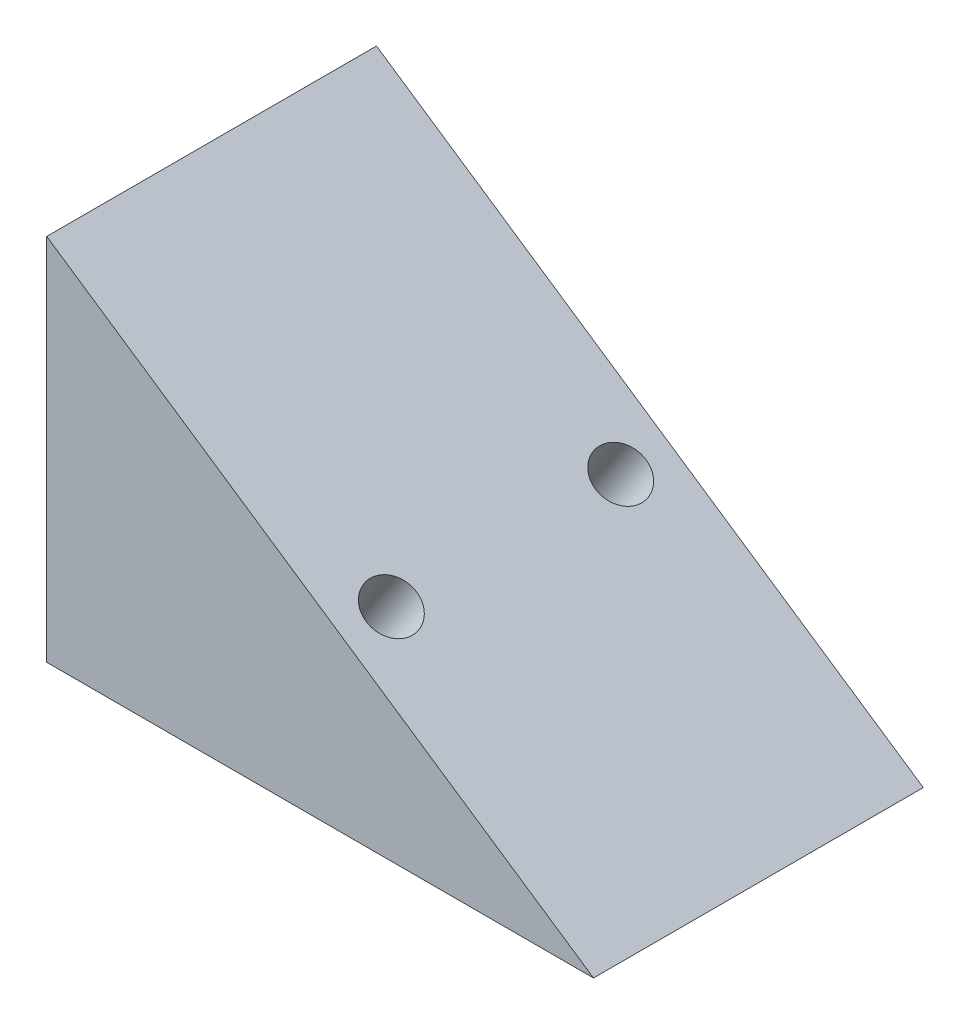
ISO-10303-21;
HEADER;
FILE_DESCRIPTION(('STEP AP214'),'2;1');
FILE_NAME('part.step','',(''),(''),'','','');
FILE_SCHEMA(('AUTOMOTIVE_DESIGN { 1 0 10303 214 1 1 1 1 }'));
ENDSEC;
DATA;
#1=APPLICATION_CONTEXT('core data for automotive mechanical design processes');
#2=APPLICATION_PROTOCOL_DEFINITION('international standard','automotive_design',2000,#1);
#3=PRODUCT_CONTEXT('',#1,'mechanical');
#4=PRODUCT('Part','Part','',(#3));
#5=PRODUCT_RELATED_PRODUCT_CATEGORY('part','',(#4));
#6=PRODUCT_DEFINITION_FORMATION('','',#4);
#7=PRODUCT_DEFINITION_CONTEXT('part definition',#1,'design');
#8=PRODUCT_DEFINITION('design','',#6,#7);
#9=PRODUCT_DEFINITION_SHAPE('','',#8);
#10=(LENGTH_UNIT() NAMED_UNIT(*) SI_UNIT(.MILLI.,.METRE.));
#11=(NAMED_UNIT(*) PLANE_ANGLE_UNIT() SI_UNIT($,.RADIAN.));
#12=(NAMED_UNIT(*) SI_UNIT($,.STERADIAN.) SOLID_ANGLE_UNIT());
#13=UNCERTAINTY_MEASURE_WITH_UNIT(LENGTH_MEASURE(1.E-05),#10,'distance_accuracy_value','');
#14=(GEOMETRIC_REPRESENTATION_CONTEXT(3) GLOBAL_UNCERTAINTY_ASSIGNED_CONTEXT((#13)) GLOBAL_UNIT_ASSIGNED_CONTEXT((#10,
#11,#12)) REPRESENTATION_CONTEXT('',''));
#15=CARTESIAN_POINT('',(0.,0.,0.));
#16=DIRECTION('',(0.,0.,1.));
#17=DIRECTION('',(1.,0.,0.));
#18=AXIS2_PLACEMENT_3D('',#15,#16,#17);
#19=CARTESIAN_POINT('',(-215.549768864311,145.390154902393,130.));
#20=DIRECTION('',(-0.559192903470744,-0.829037572555044,0.));
#21=DIRECTION('',(0.829037572555044,-0.559192903470744,0.));
#22=AXIS2_PLACEMENT_3D('',#19,#20,#21);
#23=PLANE('',#22);
#24=CARTESIAN_POINT('',(-99.4845087066052,67.1031484164894,19.8028368703547));
#25=DIRECTION('',(0.559192903470745,0.829037572555043,0.));
#26=DIRECTION('',(-0.829037572555043,0.559192903470745,0.));
#27=AXIS2_PLACEMENT_3D('',#24,#25,#26);
#28=CIRCLE('',#27,10.);
#29=CARTESIAN_POINT('',(-107.774884432156,72.6950774511968,19.8028368703547));
#30=VERTEX_POINT('',#29);
#31=EDGE_CURVE('E207',#30,#30,#28,.T.);
#32=ORIENTED_EDGE('',*,*,#31,.F.);
#33=EDGE_LOOP('',(#32));
#34=FACE_BOUND('',#33,.T.);
#35=CARTESIAN_POINT('',(-99.4845087066052,67.1031484164894,110.197163129645));
#36=DIRECTION('',(0.559192903470745,0.829037572555043,0.));
#37=DIRECTION('',(0.829037572555043,-0.559192903470745,0.));
#38=AXIS2_PLACEMENT_3D('',#35,#36,#37);
#39=CIRCLE('',#38,10.);
#40=CARTESIAN_POINT('',(-91.1941329810548,61.5112193817819,110.197163129645));
#41=VERTEX_POINT('',#40);
#42=EDGE_CURVE('E208',#41,#41,#39,.T.);
#43=ORIENTED_EDGE('',*,*,#42,.F.);
#44=EDGE_LOOP('',(#43));
#45=FACE_BOUND('',#44,.T.);
#46=DIRECTION('',(-0.829037572555044,0.559192903470744,0.));
#47=VECTOR('',#46,1.);
#48=CARTESIAN_POINT('',(-215.549768864311,145.390154902393,0.));
#49=LINE('',#48,#47);
#50=CARTESIAN_POINT('',(0.,0.,0.));
#51=VERTEX_POINT('',#50);
#52=CARTESIAN_POINT('',(-215.549768864311,145.390154902393,0.));
#53=VERTEX_POINT('',#52);
#54=EDGE_CURVE('E84',#51,#53,#49,.T.);
#55=ORIENTED_EDGE('',*,*,#54,.T.);
#56=DIRECTION('',(0.,0.,-1.));
#57=VECTOR('',#56,1.);
#58=CARTESIAN_POINT('',(-215.549768864311,145.390154902393,130.));
#59=LINE('',#58,#57);
#60=CARTESIAN_POINT('',(-215.549768864311,145.390154902393,130.));
#61=VERTEX_POINT('',#60);
#62=EDGE_CURVE('E74',#61,#53,#59,.T.);
#63=ORIENTED_EDGE('',*,*,#62,.F.);
#64=DIRECTION('',(-0.829037572555044,0.559192903470744,0.));
#65=VECTOR('',#64,1.);
#66=CARTESIAN_POINT('',(-215.549768864311,145.390154902393,130.));
#67=LINE('',#66,#65);
#68=CARTESIAN_POINT('',(0.,0.,130.));
#69=VERTEX_POINT('',#68);
#70=EDGE_CURVE('E77',#69,#61,#67,.T.);
#71=ORIENTED_EDGE('',*,*,#70,.F.);
#72=DIRECTION('',(0.,0.,-1.));
#73=VECTOR('',#72,1.);
#74=CARTESIAN_POINT('',(0.,0.,130.));
#75=LINE('',#74,#73);
#76=EDGE_CURVE('E90',#69,#51,#75,.T.);
#77=ORIENTED_EDGE('',*,*,#76,.T.);
#78=EDGE_LOOP('',(#55,#63,#71,#77));
#79=FACE_BOUND('',#78,.T.);
#80=ADVANCED_FACE('F33',(#34,#45,#79),#23,.F.);
#81=CARTESIAN_POINT('',(-215.549768864311,0.,130.));
#82=DIRECTION('',(1.,0.,0.));
#83=DIRECTION('',(0.,0.,-1.));
#84=AXIS2_PLACEMENT_3D('',#81,#82,#83);
#85=PLANE('',#84);
#86=DIRECTION('',(0.,-1.,0.));
#87=VECTOR('',#86,1.);
#88=CARTESIAN_POINT('',(-215.549768864311,0.,0.));
#89=LINE('',#88,#87);
#90=CARTESIAN_POINT('',(-215.549768864311,0.,0.));
#91=VERTEX_POINT('',#90);
#92=EDGE_CURVE('E63',#53,#91,#89,.T.);
#93=ORIENTED_EDGE('',*,*,#92,.T.);
#94=DIRECTION('',(0.,0.,-1.));
#95=VECTOR('',#94,1.);
#96=CARTESIAN_POINT('',(-215.549768864311,0.,130.));
#97=LINE('',#96,#95);
#98=CARTESIAN_POINT('',(-215.549768864311,0.,130.));
#99=VERTEX_POINT('',#98);
#100=EDGE_CURVE('E76',#99,#91,#97,.T.);
#101=ORIENTED_EDGE('',*,*,#100,.F.);
#102=DIRECTION('',(0.,-1.,0.));
#103=VECTOR('',#102,1.);
#104=CARTESIAN_POINT('',(-215.549768864311,0.,130.));
#105=LINE('',#104,#103);
#106=EDGE_CURVE('E71',#61,#99,#105,.T.);
#107=ORIENTED_EDGE('',*,*,#106,.F.);
#108=ORIENTED_EDGE('',*,*,#62,.T.);
#109=EDGE_LOOP('',(#93,#101,#107,#108));
#110=FACE_BOUND('',#109,.T.);
#111=ADVANCED_FACE('F72',(#110),#85,.F.);
#112=CARTESIAN_POINT('',(0.,0.,130.));
#113=DIRECTION('',(0.,1.,0.));
#114=DIRECTION('',(-1.,0.,0.));
#115=AXIS2_PLACEMENT_3D('',#112,#113,#114);
#116=PLANE('',#115);
#117=DIRECTION('',(1.,0.,0.));
#118=VECTOR('',#117,1.);
#119=CARTESIAN_POINT('',(0.,0.,0.));
#120=LINE('',#119,#118);
#121=EDGE_CURVE('E68',#91,#51,#120,.T.);
#122=ORIENTED_EDGE('',*,*,#121,.T.);
#123=ORIENTED_EDGE('',*,*,#76,.F.);
#124=DIRECTION('',(1.,0.,0.));
#125=VECTOR('',#124,1.);
#126=CARTESIAN_POINT('',(0.,0.,130.));
#127=LINE('',#126,#125);
#128=EDGE_CURVE('E50',#99,#69,#127,.T.);
#129=ORIENTED_EDGE('',*,*,#128,.F.);
#130=ORIENTED_EDGE('',*,*,#100,.T.);
#131=EDGE_LOOP('',(#122,#123,#129,#130));
#132=FACE_BOUND('',#131,.T.);
#133=ADVANCED_FACE('F115',(#132),#116,.F.);
#134=CARTESIAN_POINT('',(0.,0.,130.));
#135=DIRECTION('',(0.,0.,1.));
#136=DIRECTION('',(1.,0.,0.));
#137=AXIS2_PLACEMENT_3D('',#134,#135,#136);
#138=PLANE('',#137);
#139=ORIENTED_EDGE('',*,*,#70,.T.);
#140=ORIENTED_EDGE('',*,*,#106,.T.);
#141=ORIENTED_EDGE('',*,*,#128,.T.);
#142=EDGE_LOOP('',(#139,#140,#141));
#143=FACE_BOUND('',#142,.T.);
#144=ADVANCED_FACE('F80',(#143),#138,.T.);
#145=CARTESIAN_POINT('',(0.,0.,0.));
#146=DIRECTION('',(0.,0.,1.));
#147=DIRECTION('',(1.,0.,0.));
#148=AXIS2_PLACEMENT_3D('',#145,#146,#147);
#149=PLANE('',#148);
#150=ORIENTED_EDGE('',*,*,#54,.F.);
#151=ORIENTED_EDGE('',*,*,#121,.F.);
#152=ORIENTED_EDGE('',*,*,#92,.F.);
#153=EDGE_LOOP('',(#150,#151,#152));
#154=FACE_BOUND('',#153,.T.);
#155=ADVANCED_FACE('F122',(#154),#149,.F.);
#156=CARTESIAN_POINT('',(-121.852224845435,33.9416455142877,110.197163129645));
#157=DIRECTION('',(0.559192903470745,0.829037572555043,0.));
#158=DIRECTION('',(-0.829037572555043,0.559192903470745,0.));
#159=AXIS2_PLACEMENT_3D('',#156,#157,#158);
#160=CYLINDRICAL_SURFACE('',#159,10.);
#161=CARTESIAN_POINT('',(-120.733839038493,35.5997206593977,110.197163129645));
#162=DIRECTION('',(-0.559192903470745,-0.829037572555043,0.));
#163=DIRECTION('',(0.829037572555043,-0.559192903470745,0.));
#164=AXIS2_PLACEMENT_3D('',#161,#162,#163);
#165=CIRCLE('',#164,10.);
#166=CARTESIAN_POINT('',(-112.443463312943,30.0077916246903,110.197163129645));
#167=VERTEX_POINT('',#166);
#168=EDGE_CURVE('E11',#167,#167,#165,.T.);
#169=ORIENTED_EDGE('',*,*,#168,.T.);
#170=EDGE_LOOP('',(#169));
#171=FACE_BOUND('',#170,.T.);
#172=ORIENTED_EDGE('',*,*,#42,.T.);
#173=EDGE_LOOP('',(#172));
#174=FACE_BOUND('',#173,.T.);
#175=ADVANCED_FACE('F125',(#171,#174),#160,.F.);
#176=CARTESIAN_POINT('',(-121.852224845435,33.9416455142877,110.197163129645));
#177=DIRECTION('',(-0.559192903470745,-0.829037572555043,0.));
#178=DIRECTION('',(0.829037572555043,-0.559192903470745,0.));
#179=AXIS2_PLACEMENT_3D('',#176,#177,#178);
#180=PLANE('',#179);
#181=CARTESIAN_POINT('',(-121.852224845435,33.9416455142877,110.197163129645));
#182=DIRECTION('',(-0.559192903470745,-0.829037572555043,0.));
#183=DIRECTION('',(0.829037572555043,-0.559192903470745,0.));
#184=AXIS2_PLACEMENT_3D('',#181,#182,#183);
#185=CIRCLE('',#184,8.);
#186=CARTESIAN_POINT('',(-115.219924264995,29.4681022865217,110.197163129645));
#187=VERTEX_POINT('',#186);
#188=EDGE_CURVE('E42',#187,#187,#185,.F.);
#189=ORIENTED_EDGE('',*,*,#188,.T.);
#190=EDGE_LOOP('',(#189));
#191=FACE_BOUND('',#190,.T.);
#192=ADVANCED_FACE('F98',(#191),#180,.F.);
#193=CARTESIAN_POINT('',(-121.852224845435,33.9416455142877,19.8028368703547));
#194=DIRECTION('',(0.559192903470745,0.829037572555043,0.));
#195=DIRECTION('',(-0.829037572555043,0.559192903470745,0.));
#196=AXIS2_PLACEMENT_3D('',#193,#194,#195);
#197=CYLINDRICAL_SURFACE('',#196,10.);
#198=CARTESIAN_POINT('',(-120.733839038493,35.5997206593977,19.8028368703547));
#199=DIRECTION('',(0.559192903470745,0.829037572555043,0.));
#200=DIRECTION('',(-0.829037572555043,0.559192903470745,0.));
#201=AXIS2_PLACEMENT_3D('',#198,#199,#200);
#202=CIRCLE('',#201,10.);
#203=CARTESIAN_POINT('',(-129.024214764044,41.1916496941052,19.8028368703547));
#204=VERTEX_POINT('',#203);
#205=EDGE_CURVE('E88',#204,#204,#202,.F.);
#206=ORIENTED_EDGE('',*,*,#205,.T.);
#207=EDGE_LOOP('',(#206));
#208=FACE_BOUND('',#207,.T.);
#209=ORIENTED_EDGE('',*,*,#31,.T.);
#210=EDGE_LOOP('',(#209));
#211=FACE_BOUND('',#210,.T.);
#212=ADVANCED_FACE('F134',(#208,#211),#197,.F.);
#213=CARTESIAN_POINT('',(-121.852224845435,33.9416455142877,19.8028368703547));
#214=DIRECTION('',(0.559192903470745,0.829037572555043,0.));
#215=DIRECTION('',(-0.829037572555043,0.559192903470745,0.));
#216=AXIS2_PLACEMENT_3D('',#213,#214,#215);
#217=PLANE('',#216);
#218=CARTESIAN_POINT('',(-121.852224845435,33.9416455142877,19.8028368703547));
#219=DIRECTION('',(0.559192903470745,0.829037572555043,0.));
#220=DIRECTION('',(-0.829037572555043,0.559192903470745,0.));
#221=AXIS2_PLACEMENT_3D('',#218,#219,#220);
#222=CIRCLE('',#221,8.);
#223=CARTESIAN_POINT('',(-128.484525425875,38.4151887420536,19.8028368703547));
#224=VERTEX_POINT('',#223);
#225=EDGE_CURVE('E85',#224,#224,#222,.T.);
#226=ORIENTED_EDGE('',*,*,#225,.T.);
#227=EDGE_LOOP('',(#226));
#228=FACE_BOUND('',#227,.T.);
#229=ADVANCED_FACE('F106',(#228),#217,.T.);
#230=CARTESIAN_POINT('',(-120.733839038493,35.5997206593977,19.8028368703547));
#231=DIRECTION('',(0.559192903470745,0.829037572555043,0.));
#232=DIRECTION('',(-0.829037572555043,0.559192903470745,0.));
#233=AXIS2_PLACEMENT_3D('',#230,#231,#232);
#234=TOROIDAL_SURFACE('',#233,8.,2.);
#235=ORIENTED_EDGE('',*,*,#205,.F.);
#236=EDGE_LOOP('',(#235));
#237=FACE_BOUND('',#236,.T.);
#238=ORIENTED_EDGE('',*,*,#225,.F.);
#239=EDGE_LOOP('',(#238));
#240=FACE_BOUND('',#239,.T.);
#241=ADVANCED_FACE('F101',(#237,#240),#234,.F.);
#242=CARTESIAN_POINT('',(-120.733839038493,35.5997206593977,110.197163129645));
#243=DIRECTION('',(-0.559192903470745,-0.829037572555043,0.));
#244=DIRECTION('',(0.829037572555043,-0.559192903470745,0.));
#245=AXIS2_PLACEMENT_3D('',#242,#243,#244);
#246=TOROIDAL_SURFACE('',#245,8.,2.);
#247=ORIENTED_EDGE('',*,*,#168,.F.);
#248=EDGE_LOOP('',(#247));
#249=FACE_BOUND('',#248,.T.);
#250=ORIENTED_EDGE('',*,*,#188,.F.);
#251=EDGE_LOOP('',(#250));
#252=FACE_BOUND('',#251,.T.);
#253=ADVANCED_FACE('F35',(#249,#252),#246,.F.);
#254=CLOSED_SHELL('',(#80,#111,#133,#144,#155,#175,#192,#212,#229,#241,#253));
#255=MANIFOLD_SOLID_BREP('B2',#254);
#256=ADVANCED_BREP_SHAPE_REPRESENTATION('',(#18,#255),#14);
#257=SHAPE_DEFINITION_REPRESENTATION(#9,#256);
ENDSEC;
END-ISO-10303-21;
